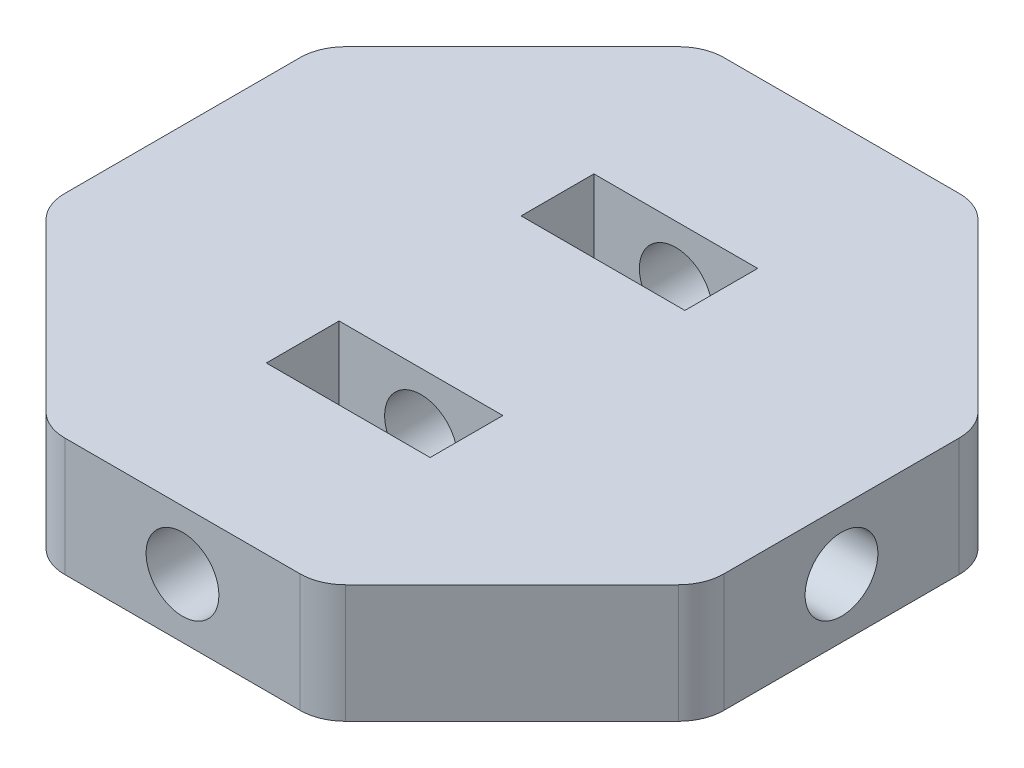
ISO-10303-21;
HEADER;
FILE_DESCRIPTION(('STEP AP214'),'2;1');
FILE_NAME('part.step','',(''),(''),'','','');
FILE_SCHEMA(('AUTOMOTIVE_DESIGN { 1 0 10303 214 1 1 1 1 }'));
ENDSEC;
DATA;
#1=APPLICATION_CONTEXT('core data for automotive mechanical design processes');
#2=APPLICATION_PROTOCOL_DEFINITION('international standard','automotive_design',2000,#1);
#3=PRODUCT_CONTEXT('',#1,'mechanical');
#4=PRODUCT('Part','Part','',(#3));
#5=PRODUCT_RELATED_PRODUCT_CATEGORY('part','',(#4));
#6=PRODUCT_DEFINITION_FORMATION('','',#4);
#7=PRODUCT_DEFINITION_CONTEXT('part definition',#1,'design');
#8=PRODUCT_DEFINITION('design','',#6,#7);
#9=PRODUCT_DEFINITION_SHAPE('','',#8);
#10=(LENGTH_UNIT() NAMED_UNIT(*) SI_UNIT(.MILLI.,.METRE.));
#11=(NAMED_UNIT(*) PLANE_ANGLE_UNIT() SI_UNIT($,.RADIAN.));
#12=(NAMED_UNIT(*) SI_UNIT($,.STERADIAN.) SOLID_ANGLE_UNIT());
#13=UNCERTAINTY_MEASURE_WITH_UNIT(LENGTH_MEASURE(1.E-05),#10,'distance_accuracy_value','');
#14=(GEOMETRIC_REPRESENTATION_CONTEXT(3) GLOBAL_UNCERTAINTY_ASSIGNED_CONTEXT((#13)) GLOBAL_UNIT_ASSIGNED_CONTEXT((#10,
#11,#12)) REPRESENTATION_CONTEXT('',''));
#15=CARTESIAN_POINT('',(0.,0.,0.));
#16=DIRECTION('',(0.,0.,1.));
#17=DIRECTION('',(1.,0.,0.));
#18=AXIS2_PLACEMENT_3D('',#15,#16,#17);
#19=CARTESIAN_POINT('',(2.5546394039017E-13,6.5,-36.213203435595));
#20=DIRECTION('',(0.,0.,1.));
#21=DIRECTION('',(1.,0.,0.));
#22=AXIS2_PLACEMENT_3D('',#19,#20,#21);
#23=CYLINDRICAL_SURFACE('',#22,4.);
#24=CARTESIAN_POINT('',(2.5546394039017E-13,6.5,-18.));
#25=DIRECTION('',(0.,0.,-1.));
#26=DIRECTION('',(-1.,0.,0.));
#27=AXIS2_PLACEMENT_3D('',#24,#25,#26);
#28=CIRCLE('',#27,4.);
#29=CARTESIAN_POINT('',(-3.99999999999974,6.5,-18.));
#30=VERTEX_POINT('',#29);
#31=EDGE_CURVE('E261',#30,#30,#28,.F.);
#32=ORIENTED_EDGE('',*,*,#31,.T.);
#33=EDGE_LOOP('',(#32));
#34=FACE_BOUND('',#33,.T.);
#35=CARTESIAN_POINT('',(2.5546394039017E-13,6.5,-36.213203435595));
#36=DIRECTION('',(0.,0.,1.));
#37=DIRECTION('',(1.,0.,0.));
#38=AXIS2_PLACEMENT_3D('',#35,#36,#37);
#39=CIRCLE('',#38,4.);
#40=CARTESIAN_POINT('',(4.00000000000026,6.5,-36.213203435595));
#41=VERTEX_POINT('',#40);
#42=EDGE_CURVE('E278',#41,#41,#39,.T.);
#43=ORIENTED_EDGE('',*,*,#42,.F.);
#44=EDGE_LOOP('',(#43));
#45=FACE_BOUND('',#44,.T.);
#46=ADVANCED_FACE('F31',(#34,#45),#23,.F.);
#47=CARTESIAN_POINT('',(2.5546394039017E-13,6.5,10.));
#48=DIRECTION('',(0.,0.,-1.));
#49=DIRECTION('',(-1.,0.,0.));
#50=AXIS2_PLACEMENT_3D('',#47,#48,#49);
#51=CIRCLE('',#50,4.);
#52=CARTESIAN_POINT('',(-3.99999999999974,6.5,10.));
#53=VERTEX_POINT('',#52);
#54=EDGE_CURVE('E285',#53,#53,#51,.F.);
#55=ORIENTED_EDGE('',*,*,#54,.T.);
#56=EDGE_LOOP('',(#55));
#57=FACE_BOUND('',#56,.T.);
#58=CARTESIAN_POINT('',(2.56101507417368E-13,6.5,-1.25767452008317E-13));
#59=DIRECTION('',(0.707106781186552,0.,-0.707106781186543));
#60=DIRECTION('',(0.707106781186543,0.,0.707106781186552));
#61=AXIS2_PLACEMENT_3D('',#58,#59,#60);
#62=ELLIPSE('',#61,5.65685424949242,4.);
#63=CARTESIAN_POINT('',(2.56101507417368E-13,2.5,-1.25767452008317E-13));
#64=VERTEX_POINT('',#63);
#65=CARTESIAN_POINT('',(2.56101507417368E-13,10.5,-1.25767452008317E-13));
#66=VERTEX_POINT('',#65);
#67=EDGE_CURVE('E315',#64,#66,#62,.F.);
#68=ORIENTED_EDGE('',*,*,#67,.F.);
#69=CARTESIAN_POINT('',(2.56101507417368E-13,6.5,-1.25767452008317E-13));
#70=DIRECTION('',(0.707106781186543,0.,0.707106781186552));
#71=DIRECTION('',(0.707106781186552,0.,-0.707106781186543));
#72=AXIS2_PLACEMENT_3D('',#69,#70,#71);
#73=ELLIPSE('',#72,5.65685424949235,4.);
#74=EDGE_CURVE('E341',#66,#64,#73,.T.);
#75=ORIENTED_EDGE('',*,*,#74,.F.);
#76=EDGE_LOOP('',(#68,#75));
#77=FACE_BOUND('',#76,.T.);
#78=ADVANCED_FACE('F494',(#57,#77),#23,.F.);
#79=CARTESIAN_POINT('',(-36.2142034355959,6.5,-5.70574324381889E-13));
#80=DIRECTION('',(1.,0.,0.));
#81=DIRECTION('',(0.,0.,-1.));
#82=AXIS2_PLACEMENT_3D('',#79,#80,#81);
#83=CYLINDRICAL_SURFACE('',#82,4.);
#84=CARTESIAN_POINT('',(36.2132034355951,6.5,3.17292438176701E-13));
#85=DIRECTION('',(1.,0.,0.));
#86=DIRECTION('',(0.,0.,-1.));
#87=AXIS2_PLACEMENT_3D('',#84,#85,#86);
#88=CIRCLE('',#87,4.);
#89=CARTESIAN_POINT('',(36.2132034355951,6.5,-3.99999999999968));
#90=VERTEX_POINT('',#89);
#91=EDGE_CURVE('E281',#90,#90,#88,.T.);
#92=ORIENTED_EDGE('',*,*,#91,.T.);
#93=EDGE_LOOP('',(#92));
#94=FACE_BOUND('',#93,.T.);
#95=ORIENTED_EDGE('',*,*,#67,.T.);
#96=CARTESIAN_POINT('',(2.56101507417368E-13,6.5,-1.25767452008317E-13));
#97=DIRECTION('',(0.707106781186543,0.,0.707106781186552));
#98=DIRECTION('',(0.707106781186552,0.,-0.707106781186543));
#99=AXIS2_PLACEMENT_3D('',#96,#97,#98);
#100=ELLIPSE('',#99,5.65685424949235,4.);
#101=EDGE_CURVE('E344',#66,#64,#100,.F.);
#102=ORIENTED_EDGE('',*,*,#101,.T.);
#103=EDGE_LOOP('',(#95,#102));
#104=FACE_BOUND('',#103,.T.);
#105=ADVANCED_FACE('F501',(#94,#104),#83,.F.);
#106=CARTESIAN_POINT('',(36.2132034355949,13.,15.0000000000009));
#107=DIRECTION('',(-1.,0.,0.));
#108=DIRECTION('',(0.,0.,1.));
#109=AXIS2_PLACEMENT_3D('',#106,#107,#108);
#110=PLANE('',#109);
#111=ORIENTED_EDGE('',*,*,#91,.F.);
#112=EDGE_LOOP('',(#111));
#113=FACE_BOUND('',#112,.T.);
#114=DIRECTION('',(0.,0.,-1.));
#115=VECTOR('',#114,1.);
#116=CARTESIAN_POINT('',(36.2132034355949,0.,15.0000000000009));
#117=LINE('',#116,#115);
#118=CARTESIAN_POINT('',(36.2132034355949,0.,12.9289321881355));
#119=VERTEX_POINT('',#118);
#120=CARTESIAN_POINT('',(36.2132034355952,0.,-12.9289321881348));
#121=VERTEX_POINT('',#120);
#122=EDGE_CURVE('E291',#119,#121,#117,.T.);
#123=ORIENTED_EDGE('',*,*,#122,.T.);
#124=DIRECTION('',(0.,-1.,0.));
#125=VECTOR('',#124,1.);
#126=CARTESIAN_POINT('',(36.2132034355952,13.,-12.9289321881348));
#127=LINE('',#126,#125);
#128=CARTESIAN_POINT('',(36.2132034355952,13.,-12.9289321881348));
#129=VERTEX_POINT('',#128);
#130=EDGE_CURVE('E399',#121,#129,#127,.F.);
#131=ORIENTED_EDGE('',*,*,#130,.T.);
#132=DIRECTION('',(0.,0.,-1.));
#133=VECTOR('',#132,1.);
#134=CARTESIAN_POINT('',(36.2132034355949,13.,15.0000000000009));
#135=LINE('',#134,#133);
#136=CARTESIAN_POINT('',(36.2132034355949,13.,12.9289321881355));
#137=VERTEX_POINT('',#136);
#138=EDGE_CURVE('E292',#137,#129,#135,.T.);
#139=ORIENTED_EDGE('',*,*,#138,.F.);
#140=DIRECTION('',(0.,-1.,0.));
#141=VECTOR('',#140,1.);
#142=CARTESIAN_POINT('',(36.2132034355949,13.,12.9289321881355));
#143=LINE('',#142,#141);
#144=EDGE_CURVE('E396',#137,#119,#143,.T.);
#145=ORIENTED_EDGE('',*,*,#144,.T.);
#146=EDGE_LOOP('',(#123,#131,#139,#145));
#147=FACE_BOUND('',#146,.T.);
#148=ADVANCED_FACE('F470',(#113,#147),#110,.F.);
#149=CARTESIAN_POINT('',(36.2132034355953,13.,-15.0000000000003));
#150=DIRECTION('',(-0.707106781186547,0.,0.707106781186548));
#151=DIRECTION('',(0.707106781186548,0.,0.707106781186547));
#152=AXIS2_PLACEMENT_3D('',#149,#150,#151);
#153=PLANE('',#152);
#154=DIRECTION('',(-0.707106781186548,0.,-0.707106781186547));
#155=VECTOR('',#154,1.);
#156=CARTESIAN_POINT('',(36.2132034355953,0.,-15.0000000000003));
#157=LINE('',#156,#155);
#158=CARTESIAN_POINT('',(34.748737341528,0.,-16.4644660940676));
#159=VERTEX_POINT('',#158);
#160=CARTESIAN_POINT('',(16.4644660940678,0.,-34.7487373415278));
#161=VERTEX_POINT('',#160);
#162=EDGE_CURVE('E318',#159,#161,#157,.T.);
#163=ORIENTED_EDGE('',*,*,#162,.T.);
#164=DIRECTION('',(0.,-1.,0.));
#165=VECTOR('',#164,1.);
#166=CARTESIAN_POINT('',(16.4644660940678,13.,-34.7487373415278));
#167=LINE('',#166,#165);
#168=CARTESIAN_POINT('',(16.4644660940678,13.,-34.7487373415278));
#169=VERTEX_POINT('',#168);
#170=EDGE_CURVE('E379',#161,#169,#167,.F.);
#171=ORIENTED_EDGE('',*,*,#170,.T.);
#172=DIRECTION('',(-0.707106781186548,0.,-0.707106781186547));
#173=VECTOR('',#172,1.);
#174=CARTESIAN_POINT('',(36.2132034355953,13.,-15.0000000000003));
#175=LINE('',#174,#173);
#176=CARTESIAN_POINT('',(34.748737341528,13.,-16.4644660940676));
#177=VERTEX_POINT('',#176);
#178=EDGE_CURVE('E295',#177,#169,#175,.T.);
#179=ORIENTED_EDGE('',*,*,#178,.F.);
#180=DIRECTION('',(0.,-1.,0.));
#181=VECTOR('',#180,1.);
#182=CARTESIAN_POINT('',(34.748737341528,13.,-16.4644660940676));
#183=LINE('',#182,#181);
#184=EDGE_CURVE('E376',#177,#159,#183,.T.);
#185=ORIENTED_EDGE('',*,*,#184,.T.);
#186=EDGE_LOOP('',(#163,#171,#179,#185));
#187=FACE_BOUND('',#186,.T.);
#188=ADVANCED_FACE('F479',(#187),#153,.F.);
#189=CARTESIAN_POINT('',(15.0000000000005,13.,-36.213203435595));
#190=DIRECTION('',(0.,0.,1.));
#191=DIRECTION('',(1.,0.,0.));
#192=AXIS2_PLACEMENT_3D('',#189,#190,#191);
#193=PLANE('',#192);
#194=ORIENTED_EDGE('',*,*,#42,.T.);
#195=EDGE_LOOP('',(#194));
#196=FACE_BOUND('',#195,.T.);
#197=DIRECTION('',(-1.,0.,0.));
#198=VECTOR('',#197,1.);
#199=CARTESIAN_POINT('',(15.0000000000005,13.,-36.213203435595));
#200=LINE('',#199,#198);
#201=CARTESIAN_POINT('',(12.928932188135,13.,-36.213203435595));
#202=VERTEX_POINT('',#201);
#203=CARTESIAN_POINT('',(-12.9289321881339,13.,-36.213203435595));
#204=VERTEX_POINT('',#203);
#205=EDGE_CURVE('E299',#202,#204,#200,.T.);
#206=ORIENTED_EDGE('',*,*,#205,.F.);
#207=DIRECTION('',(0.,-1.,0.));
#208=VECTOR('',#207,1.);
#209=CARTESIAN_POINT('',(12.928932188135,13.,-36.213203435595));
#210=LINE('',#209,#208);
#211=CARTESIAN_POINT('',(12.928932188135,0.,-36.213203435595));
#212=VERTEX_POINT('',#211);
#213=EDGE_CURVE('E357',#202,#212,#210,.T.);
#214=ORIENTED_EDGE('',*,*,#213,.T.);
#215=DIRECTION('',(-1.,0.,0.));
#216=VECTOR('',#215,1.);
#217=CARTESIAN_POINT('',(15.0000000000005,0.,-36.213203435595));
#218=LINE('',#217,#216);
#219=CARTESIAN_POINT('',(-12.9289321881339,0.,-36.213203435595));
#220=VERTEX_POINT('',#219);
#221=EDGE_CURVE('E321',#212,#220,#218,.T.);
#222=ORIENTED_EDGE('',*,*,#221,.T.);
#223=DIRECTION('',(0.,-1.,0.));
#224=VECTOR('',#223,1.);
#225=CARTESIAN_POINT('',(-12.9289321881339,13.,-36.213203435595));
#226=LINE('',#225,#224);
#227=EDGE_CURVE('E347',#220,#204,#226,.F.);
#228=ORIENTED_EDGE('',*,*,#227,.T.);
#229=EDGE_LOOP('',(#206,#214,#222,#228));
#230=FACE_BOUND('',#229,.T.);
#231=ADVANCED_FACE('F487',(#196,#230),#193,.F.);
#232=CARTESIAN_POINT('',(-14.9999999999994,13.,-36.213203435595));
#233=DIRECTION('',(0.707106781186548,0.,0.707106781186547));
#234=DIRECTION('',(0.707106781186547,0.,-0.707106781186548));
#235=AXIS2_PLACEMENT_3D('',#232,#233,#234);
#236=PLANE('',#235);
#237=DIRECTION('',(-0.707106781186547,0.,0.707106781186548));
#238=VECTOR('',#237,1.);
#239=CARTESIAN_POINT('',(-14.9999999999994,0.,-36.213203435595));
#240=LINE('',#239,#238);
#241=CARTESIAN_POINT('',(-16.4644660940666,0.,-34.7487373415278));
#242=VERTEX_POINT('',#241);
#243=CARTESIAN_POINT('',(-34.7487373415282,0.,-16.4644660940662));
#244=VERTEX_POINT('',#243);
#245=EDGE_CURVE('E324',#242,#244,#240,.T.);
#246=ORIENTED_EDGE('',*,*,#245,.T.);
#247=DIRECTION('',(0.,-1.,0.));
#248=VECTOR('',#247,1.);
#249=CARTESIAN_POINT('',(-34.7487373415282,13.,-16.4644660940661));
#250=LINE('',#249,#248);
#251=CARTESIAN_POINT('',(-34.7487373415282,13.,-16.4644660940662));
#252=VERTEX_POINT('',#251);
#253=EDGE_CURVE('E11',#244,#252,#250,.F.);
#254=ORIENTED_EDGE('',*,*,#253,.T.);
#255=DIRECTION('',(-0.707106781186547,0.,0.707106781186548));
#256=VECTOR('',#255,1.);
#257=CARTESIAN_POINT('',(-14.9999999999994,13.,-36.213203435595));
#258=LINE('',#257,#256);
#259=CARTESIAN_POINT('',(-16.4644660940666,13.,-34.7487373415278));
#260=VERTEX_POINT('',#259);
#261=EDGE_CURVE('E302',#260,#252,#258,.T.);
#262=ORIENTED_EDGE('',*,*,#261,.F.);
#263=DIRECTION('',(0.,-1.,0.));
#264=VECTOR('',#263,1.);
#265=CARTESIAN_POINT('',(-16.4644660940666,13.,-34.7487373415278));
#266=LINE('',#265,#264);
#267=EDGE_CURVE('E39',#260,#242,#266,.T.);
#268=ORIENTED_EDGE('',*,*,#267,.T.);
#269=EDGE_LOOP('',(#246,#254,#262,#268));
#270=FACE_BOUND('',#269,.T.);
#271=ADVANCED_FACE('F424',(#270),#236,.F.);
#272=CARTESIAN_POINT('',(-36.2132034355955,13.,-14.9999999999989));
#273=DIRECTION('',(1.,0.,0.));
#274=DIRECTION('',(0.,0.,-1.));
#275=AXIS2_PLACEMENT_3D('',#272,#273,#274);
#276=PLANE('',#275);
#277=CARTESIAN_POINT('',(-36.2132034355955,6.5,-5.7056206566932E-13));
#278=DIRECTION('',(1.,0.,0.));
#279=DIRECTION('',(0.,0.,-1.));
#280=AXIS2_PLACEMENT_3D('',#277,#278,#279);
#281=CIRCLE('',#280,4.);
#282=CARTESIAN_POINT('',(-36.2132034355955,6.5,-4.00000000000057));
#283=VERTEX_POINT('',#282);
#284=EDGE_CURVE('E288',#283,#283,#281,.F.);
#285=ORIENTED_EDGE('',*,*,#284,.F.);
#286=EDGE_LOOP('',(#285));
#287=FACE_BOUND('',#286,.T.);
#288=DIRECTION('',(0.,0.,1.));
#289=VECTOR('',#288,1.);
#290=CARTESIAN_POINT('',(-36.2132034355955,0.,-14.9999999999989));
#291=LINE('',#290,#289);
#292=CARTESIAN_POINT('',(-36.2132034355955,0.,-12.9289321881334));
#293=VERTEX_POINT('',#292);
#294=CARTESIAN_POINT('',(-36.2132034355955,0.,12.9289321881354));
#295=VERTEX_POINT('',#294);
#296=EDGE_CURVE('E327',#293,#295,#291,.T.);
#297=ORIENTED_EDGE('',*,*,#296,.T.);
#298=DIRECTION('',(0.,-1.,0.));
#299=VECTOR('',#298,1.);
#300=CARTESIAN_POINT('',(-36.2132034355955,13.,12.9289321881354));
#301=LINE('',#300,#299);
#302=CARTESIAN_POINT('',(-36.2132034355955,13.,12.9289321881354));
#303=VERTEX_POINT('',#302);
#304=EDGE_CURVE('E418',#295,#303,#301,.F.);
#305=ORIENTED_EDGE('',*,*,#304,.T.);
#306=DIRECTION('',(0.,0.,1.));
#307=VECTOR('',#306,1.);
#308=CARTESIAN_POINT('',(-36.2132034355955,13.,-14.9999999999989));
#309=LINE('',#308,#307);
#310=CARTESIAN_POINT('',(-36.2132034355955,13.,-12.9289321881334));
#311=VERTEX_POINT('',#310);
#312=EDGE_CURVE('E305',#311,#303,#309,.T.);
#313=ORIENTED_EDGE('',*,*,#312,.F.);
#314=DIRECTION('',(0.,-1.,0.));
#315=VECTOR('',#314,1.);
#316=CARTESIAN_POINT('',(-36.2132034355955,13.,-12.9289321881334));
#317=LINE('',#316,#315);
#318=EDGE_CURVE('E415',#311,#293,#317,.T.);
#319=ORIENTED_EDGE('',*,*,#318,.T.);
#320=EDGE_LOOP('',(#297,#305,#313,#319));
#321=FACE_BOUND('',#320,.T.);
#322=ADVANCED_FACE('F437',(#287,#321),#276,.F.);
#323=CARTESIAN_POINT('',(-36.2132034355955,13.,15.0000000000009));
#324=DIRECTION('',(0.707106781186535,0.,-0.70710678118656));
#325=DIRECTION('',(-0.70710678118656,0.,-0.707106781186535));
#326=AXIS2_PLACEMENT_3D('',#323,#324,#325);
#327=PLANE('',#326);
#328=DIRECTION('',(0.70710678118656,0.,0.707106781186535));
#329=VECTOR('',#328,1.);
#330=CARTESIAN_POINT('',(-36.2132034355955,0.,15.0000000000009));
#331=LINE('',#330,#329);
#332=CARTESIAN_POINT('',(-34.7487373415282,0.,16.4644660940682));
#333=VERTEX_POINT('',#332);
#334=CARTESIAN_POINT('',(-16.4644660940672,0.,34.7487373415285));
#335=VERTEX_POINT('',#334);
#336=EDGE_CURVE('E330',#333,#335,#331,.T.);
#337=ORIENTED_EDGE('',*,*,#336,.T.);
#338=DIRECTION('',(0.,-1.,0.));
#339=VECTOR('',#338,1.);
#340=CARTESIAN_POINT('',(-16.4644660940672,13.,34.7487373415285));
#341=LINE('',#340,#339);
#342=CARTESIAN_POINT('',(-16.4644660940672,13.,34.7487373415285));
#343=VERTEX_POINT('',#342);
#344=EDGE_CURVE('E413',#335,#343,#341,.F.);
#345=ORIENTED_EDGE('',*,*,#344,.T.);
#346=DIRECTION('',(0.70710678118656,0.,0.707106781186535));
#347=VECTOR('',#346,1.);
#348=CARTESIAN_POINT('',(-36.2132034355955,13.,15.0000000000009));
#349=LINE('',#348,#347);
#350=CARTESIAN_POINT('',(-34.7487373415282,13.,16.4644660940682));
#351=VERTEX_POINT('',#350);
#352=EDGE_CURVE('E308',#351,#343,#349,.T.);
#353=ORIENTED_EDGE('',*,*,#352,.F.);
#354=DIRECTION('',(0.,-1.,0.));
#355=VECTOR('',#354,1.);
#356=CARTESIAN_POINT('',(-34.7487373415282,13.,16.4644660940682));
#357=LINE('',#356,#355);
#358=EDGE_CURVE('E410',#351,#333,#357,.T.);
#359=ORIENTED_EDGE('',*,*,#358,.T.);
#360=EDGE_LOOP('',(#337,#345,#353,#359));
#361=FACE_BOUND('',#360,.T.);
#362=ADVANCED_FACE('F447',(#361),#327,.F.);
#363=CARTESIAN_POINT('',(-15.,13.,36.2132034355957));
#364=DIRECTION('',(0.,0.,-1.));
#365=DIRECTION('',(-1.,0.,0.));
#366=AXIS2_PLACEMENT_3D('',#363,#364,#365);
#367=PLANE('',#366);
#368=CARTESIAN_POINT('',(2.5546394039017E-13,6.5,36.2132034355959));
#369=DIRECTION('',(0.,0.,1.));
#370=DIRECTION('',(1.,0.,0.));
#371=AXIS2_PLACEMENT_3D('',#368,#369,#370);
#372=CIRCLE('',#371,4.);
#373=CARTESIAN_POINT('',(4.00000000000026,6.5,36.2132034355959));
#374=VERTEX_POINT('',#373);
#375=EDGE_CURVE('E282',#374,#374,#372,.T.);
#376=ORIENTED_EDGE('',*,*,#375,.F.);
#377=EDGE_LOOP('',(#376));
#378=FACE_BOUND('',#377,.T.);
#379=DIRECTION('',(1.,0.,0.));
#380=VECTOR('',#379,1.);
#381=CARTESIAN_POINT('',(-15.,0.,36.2132034355957));
#382=LINE('',#381,#380);
#383=CARTESIAN_POINT('',(-12.9289321881346,0.,36.2132034355957));
#384=VERTEX_POINT('',#383);
#385=CARTESIAN_POINT('',(12.9289321881349,0.,36.213203435596));
#386=VERTEX_POINT('',#385);
#387=EDGE_CURVE('E333',#384,#386,#382,.T.);
#388=ORIENTED_EDGE('',*,*,#387,.T.);
#389=DIRECTION('',(0.,-1.,0.));
#390=VECTOR('',#389,1.);
#391=CARTESIAN_POINT('',(12.9289321881349,13.,36.213203435596));
#392=LINE('',#391,#390);
#393=CARTESIAN_POINT('',(12.9289321881349,13.,36.213203435596));
#394=VERTEX_POINT('',#393);
#395=EDGE_CURVE('E408',#386,#394,#392,.F.);
#396=ORIENTED_EDGE('',*,*,#395,.T.);
#397=DIRECTION('',(1.,0.,0.));
#398=VECTOR('',#397,1.);
#399=CARTESIAN_POINT('',(-15.,13.,36.2132034355957));
#400=LINE('',#399,#398);
#401=CARTESIAN_POINT('',(-12.9289321881346,13.,36.2132034355957));
#402=VERTEX_POINT('',#401);
#403=EDGE_CURVE('E311',#402,#394,#400,.T.);
#404=ORIENTED_EDGE('',*,*,#403,.F.);
#405=DIRECTION('',(0.,-1.,0.));
#406=VECTOR('',#405,1.);
#407=CARTESIAN_POINT('',(-12.9289321881346,13.,36.2132034355957));
#408=LINE('',#407,#406);
#409=EDGE_CURVE('E405',#402,#384,#408,.T.);
#410=ORIENTED_EDGE('',*,*,#409,.T.);
#411=EDGE_LOOP('',(#388,#396,#404,#410));
#412=FACE_BOUND('',#411,.T.);
#413=ADVANCED_FACE('F456',(#378,#412),#367,.F.);
#414=CARTESIAN_POINT('',(15.0000000000005,13.,36.2132034355961));
#415=DIRECTION('',(-0.70710678118656,0.,-0.707106781186535));
#416=DIRECTION('',(-0.707106781186535,0.,0.70710678118656));
#417=AXIS2_PLACEMENT_3D('',#414,#415,#416);
#418=PLANE('',#417);
#419=DIRECTION('',(0.707106781186535,0.,-0.70710678118656));
#420=VECTOR('',#419,1.);
#421=CARTESIAN_POINT('',(15.0000000000005,0.,36.2132034355961));
#422=LINE('',#421,#420);
#423=CARTESIAN_POINT('',(16.4644660940678,0.,34.7487373415287));
#424=VERTEX_POINT('',#423);
#425=CARTESIAN_POINT('',(34.7487373415277,0.,16.4644660940682));
#426=VERTEX_POINT('',#425);
#427=EDGE_CURVE('E296',#424,#426,#422,.T.);
#428=ORIENTED_EDGE('',*,*,#427,.T.);
#429=DIRECTION('',(0.,-1.,0.));
#430=VECTOR('',#429,1.);
#431=CARTESIAN_POINT('',(34.7487373415277,13.,16.4644660940682));
#432=LINE('',#431,#430);
#433=CARTESIAN_POINT('',(34.7487373415277,13.,16.4644660940682));
#434=VERTEX_POINT('',#433);
#435=EDGE_CURVE('E46',#426,#434,#432,.F.);
#436=ORIENTED_EDGE('',*,*,#435,.T.);
#437=DIRECTION('',(0.707106781186535,0.,-0.70710678118656));
#438=VECTOR('',#437,1.);
#439=CARTESIAN_POINT('',(15.0000000000005,13.,36.2132034355961));
#440=LINE('',#439,#438);
#441=CARTESIAN_POINT('',(16.4644660940678,13.,34.7487373415287));
#442=VERTEX_POINT('',#441);
#443=EDGE_CURVE('E313',#442,#434,#440,.T.);
#444=ORIENTED_EDGE('',*,*,#443,.F.);
#445=DIRECTION('',(0.,-1.,0.));
#446=VECTOR('',#445,1.);
#447=CARTESIAN_POINT('',(16.4644660940678,13.,34.7487373415287));
#448=LINE('',#447,#446);
#449=EDGE_CURVE('E401',#442,#424,#448,.T.);
#450=ORIENTED_EDGE('',*,*,#449,.T.);
#451=EDGE_LOOP('',(#428,#436,#444,#450));
#452=FACE_BOUND('',#451,.T.);
#453=ADVANCED_FACE('F462',(#452),#418,.F.);
#454=CARTESIAN_POINT('',(36.2132034355955,13.,-36.213203435595));
#455=DIRECTION('',(0.,1.,0.));
#456=DIRECTION('',(0.,0.,1.));
#457=AXIS2_PLACEMENT_3D('',#454,#455,#456);
#458=PLANE('',#457);
#459=DIRECTION('',(0.,0.,1.));
#460=VECTOR('',#459,1.);
#461=CARTESIAN_POINT('',(-9.,13.,-10.));
#462=LINE('',#461,#460);
#463=CARTESIAN_POINT('',(-9.,13.,-18.));
#464=VERTEX_POINT('',#463);
#465=CARTESIAN_POINT('',(-8.99999999999999,13.,-10.));
#466=VERTEX_POINT('',#465);
#467=EDGE_CURVE('E206',#464,#466,#462,.T.);
#468=ORIENTED_EDGE('',*,*,#467,.F.);
#469=DIRECTION('',(-1.,0.,0.));
#470=VECTOR('',#469,1.);
#471=CARTESIAN_POINT('',(-9.,13.,-18.));
#472=LINE('',#471,#470);
#473=CARTESIAN_POINT('',(9.,13.,-18.));
#474=VERTEX_POINT('',#473);
#475=EDGE_CURVE('E225',#474,#464,#472,.T.);
#476=ORIENTED_EDGE('',*,*,#475,.F.);
#477=DIRECTION('',(0.,0.,-1.));
#478=VECTOR('',#477,1.);
#479=CARTESIAN_POINT('',(9.,13.,-10.));
#480=LINE('',#479,#478);
#481=CARTESIAN_POINT('',(9.,13.,-10.));
#482=VERTEX_POINT('',#481);
#483=EDGE_CURVE('E228',#482,#474,#480,.T.);
#484=ORIENTED_EDGE('',*,*,#483,.F.);
#485=DIRECTION('',(1.,0.,0.));
#486=VECTOR('',#485,1.);
#487=CARTESIAN_POINT('',(-9.,13.,-10.));
#488=LINE('',#487,#486);
#489=EDGE_CURVE('E234',#466,#482,#488,.T.);
#490=ORIENTED_EDGE('',*,*,#489,.F.);
#491=EDGE_LOOP('',(#468,#476,#484,#490));
#492=FACE_BOUND('',#491,.T.);
#493=DIRECTION('',(0.,0.,1.));
#494=VECTOR('',#493,1.);
#495=CARTESIAN_POINT('',(-9.,13.,10.));
#496=LINE('',#495,#494);
#497=CARTESIAN_POINT('',(-9.,13.,10.));
#498=VERTEX_POINT('',#497);
#499=CARTESIAN_POINT('',(-8.99999999999999,13.,18.));
#500=VERTEX_POINT('',#499);
#501=EDGE_CURVE('E258',#498,#500,#496,.T.);
#502=ORIENTED_EDGE('',*,*,#501,.F.);
#503=DIRECTION('',(-1.,0.,0.));
#504=VECTOR('',#503,1.);
#505=CARTESIAN_POINT('',(-9.,13.,10.));
#506=LINE('',#505,#504);
#507=CARTESIAN_POINT('',(9.,13.,10.));
#508=VERTEX_POINT('',#507);
#509=EDGE_CURVE('E248',#508,#498,#506,.T.);
#510=ORIENTED_EDGE('',*,*,#509,.F.);
#511=DIRECTION('',(0.,0.,-1.));
#512=VECTOR('',#511,1.);
#513=CARTESIAN_POINT('',(9.,13.,10.));
#514=LINE('',#513,#512);
#515=CARTESIAN_POINT('',(9.,13.,18.));
#516=VERTEX_POINT('',#515);
#517=EDGE_CURVE('E264',#516,#508,#514,.T.);
#518=ORIENTED_EDGE('',*,*,#517,.F.);
#519=DIRECTION('',(1.,0.,0.));
#520=VECTOR('',#519,1.);
#521=CARTESIAN_POINT('',(-9.,13.,18.));
#522=LINE('',#521,#520);
#523=EDGE_CURVE('E260',#500,#516,#522,.T.);
#524=ORIENTED_EDGE('',*,*,#523,.F.);
#525=EDGE_LOOP('',(#502,#510,#518,#524));
#526=FACE_BOUND('',#525,.T.);
#527=ORIENTED_EDGE('',*,*,#178,.T.);
#528=CARTESIAN_POINT('',(12.928932188135,13.,-31.213203435595));
#529=DIRECTION('',(0.,1.,0.));
#530=DIRECTION('',(0.,0.,1.));
#531=AXIS2_PLACEMENT_3D('',#528,#529,#530);
#532=CIRCLE('',#531,5.);
#533=EDGE_CURVE('E394',#169,#202,#532,.T.);
#534=ORIENTED_EDGE('',*,*,#533,.T.);
#535=ORIENTED_EDGE('',*,*,#205,.T.);
#536=CARTESIAN_POINT('',(-12.9289321881339,13.,-31.213203435595));
#537=DIRECTION('',(0.,1.,0.));
#538=DIRECTION('',(0.,0.,1.));
#539=AXIS2_PLACEMENT_3D('',#536,#537,#538);
#540=CIRCLE('',#539,5.);
#541=EDGE_CURVE('E381',#204,#260,#540,.T.);
#542=ORIENTED_EDGE('',*,*,#541,.T.);
#543=ORIENTED_EDGE('',*,*,#261,.T.);
#544=CARTESIAN_POINT('',(-31.2132034355955,13.,-12.9289321881334));
#545=DIRECTION('',(0.,1.,0.));
#546=DIRECTION('',(0.,0.,1.));
#547=AXIS2_PLACEMENT_3D('',#544,#545,#546);
#548=CIRCLE('',#547,5.);
#549=EDGE_CURVE('E383',#252,#311,#548,.T.);
#550=ORIENTED_EDGE('',*,*,#549,.T.);
#551=ORIENTED_EDGE('',*,*,#312,.T.);
#552=CARTESIAN_POINT('',(-31.2132034355955,13.,12.9289321881354));
#553=DIRECTION('',(0.,1.,0.));
#554=DIRECTION('',(0.,0.,1.));
#555=AXIS2_PLACEMENT_3D('',#552,#553,#554);
#556=CIRCLE('',#555,5.);
#557=EDGE_CURVE('E385',#303,#351,#556,.T.);
#558=ORIENTED_EDGE('',*,*,#557,.T.);
#559=ORIENTED_EDGE('',*,*,#352,.T.);
#560=CARTESIAN_POINT('',(-12.9289321881345,13.,31.2132034355957));
#561=DIRECTION('',(0.,1.,0.));
#562=DIRECTION('',(0.,0.,1.));
#563=AXIS2_PLACEMENT_3D('',#560,#561,#562);
#564=CIRCLE('',#563,5.);
#565=EDGE_CURVE('E387',#343,#402,#564,.T.);
#566=ORIENTED_EDGE('',*,*,#565,.T.);
#567=ORIENTED_EDGE('',*,*,#403,.T.);
#568=CARTESIAN_POINT('',(12.928932188135,13.,31.213203435596));
#569=DIRECTION('',(0.,1.,0.));
#570=DIRECTION('',(0.,0.,1.));
#571=AXIS2_PLACEMENT_3D('',#568,#569,#570);
#572=CIRCLE('',#571,5.);
#573=EDGE_CURVE('E53',#394,#442,#572,.T.);
#574=ORIENTED_EDGE('',*,*,#573,.T.);
#575=ORIENTED_EDGE('',*,*,#443,.T.);
#576=CARTESIAN_POINT('',(31.2132034355949,13.,12.9289321881355));
#577=DIRECTION('',(0.,1.,0.));
#578=DIRECTION('',(0.,0.,1.));
#579=AXIS2_PLACEMENT_3D('',#576,#577,#578);
#580=CIRCLE('',#579,5.);
#581=EDGE_CURVE('E390',#434,#137,#580,.T.);
#582=ORIENTED_EDGE('',*,*,#581,.T.);
#583=ORIENTED_EDGE('',*,*,#138,.T.);
#584=CARTESIAN_POINT('',(31.2132034355952,13.,-12.9289321881348));
#585=DIRECTION('',(0.,1.,0.));
#586=DIRECTION('',(0.,0.,1.));
#587=AXIS2_PLACEMENT_3D('',#584,#585,#586);
#588=CIRCLE('',#587,5.);
#589=EDGE_CURVE('E392',#129,#177,#588,.T.);
#590=ORIENTED_EDGE('',*,*,#589,.T.);
#591=EDGE_LOOP('',(#527,#534,#535,#542,#543,#550,#551,#558,#559,#566,#567,#574,#575,#582,#583,#590));
#592=FACE_BOUND('',#591,.T.);
#593=ADVANCED_FACE('F440',(#492,#526,#592),#458,.T.);
#594=CARTESIAN_POINT('',(36.2132034355955,0.,-36.213203435595));
#595=DIRECTION('',(0.,1.,0.));
#596=DIRECTION('',(0.,0.,1.));
#597=AXIS2_PLACEMENT_3D('',#594,#595,#596);
#598=PLANE('',#597);
#599=DIRECTION('',(-1.,0.,0.));
#600=VECTOR('',#599,1.);
#601=CARTESIAN_POINT('',(-9.,0.,-18.));
#602=LINE('',#601,#600);
#603=CARTESIAN_POINT('',(9.,0.,-18.));
#604=VERTEX_POINT('',#603);
#605=CARTESIAN_POINT('',(-9.,0.,-18.));
#606=VERTEX_POINT('',#605);
#607=EDGE_CURVE('E211',#604,#606,#602,.T.);
#608=ORIENTED_EDGE('',*,*,#607,.T.);
#609=DIRECTION('',(0.,0.,1.));
#610=VECTOR('',#609,1.);
#611=CARTESIAN_POINT('',(-9.,0.,-10.));
#612=LINE('',#611,#610);
#613=CARTESIAN_POINT('',(-9.,0.,-10.));
#614=VERTEX_POINT('',#613);
#615=EDGE_CURVE('E203',#606,#614,#612,.T.);
#616=ORIENTED_EDGE('',*,*,#615,.T.);
#617=DIRECTION('',(1.,0.,0.));
#618=VECTOR('',#617,1.);
#619=CARTESIAN_POINT('',(-9.,0.,-10.));
#620=LINE('',#619,#618);
#621=CARTESIAN_POINT('',(8.99999999999999,0.,-10.));
#622=VERTEX_POINT('',#621);
#623=EDGE_CURVE('E215',#614,#622,#620,.T.);
#624=ORIENTED_EDGE('',*,*,#623,.T.);
#625=DIRECTION('',(0.,0.,-1.));
#626=VECTOR('',#625,1.);
#627=CARTESIAN_POINT('',(9.,0.,-10.));
#628=LINE('',#627,#626);
#629=EDGE_CURVE('E220',#622,#604,#628,.T.);
#630=ORIENTED_EDGE('',*,*,#629,.T.);
#631=EDGE_LOOP('',(#608,#616,#624,#630));
#632=FACE_BOUND('',#631,.T.);
#633=DIRECTION('',(-1.,0.,0.));
#634=VECTOR('',#633,1.);
#635=CARTESIAN_POINT('',(-9.,0.,10.));
#636=LINE('',#635,#634);
#637=CARTESIAN_POINT('',(9.,0.,10.));
#638=VERTEX_POINT('',#637);
#639=CARTESIAN_POINT('',(-9.,0.,10.));
#640=VERTEX_POINT('',#639);
#641=EDGE_CURVE('E254',#638,#640,#636,.T.);
#642=ORIENTED_EDGE('',*,*,#641,.T.);
#643=DIRECTION('',(0.,0.,1.));
#644=VECTOR('',#643,1.);
#645=CARTESIAN_POINT('',(-9.,0.,10.));
#646=LINE('',#645,#644);
#647=CARTESIAN_POINT('',(-9.,0.,18.));
#648=VERTEX_POINT('',#647);
#649=EDGE_CURVE('E244',#640,#648,#646,.T.);
#650=ORIENTED_EDGE('',*,*,#649,.T.);
#651=DIRECTION('',(1.,0.,0.));
#652=VECTOR('',#651,1.);
#653=CARTESIAN_POINT('',(-9.,0.,18.));
#654=LINE('',#653,#652);
#655=CARTESIAN_POINT('',(9.,0.,18.));
#656=VERTEX_POINT('',#655);
#657=EDGE_CURVE('E247',#648,#656,#654,.T.);
#658=ORIENTED_EDGE('',*,*,#657,.T.);
#659=DIRECTION('',(0.,0.,-1.));
#660=VECTOR('',#659,1.);
#661=CARTESIAN_POINT('',(9.,0.,10.));
#662=LINE('',#661,#660);
#663=EDGE_CURVE('E251',#656,#638,#662,.T.);
#664=ORIENTED_EDGE('',*,*,#663,.T.);
#665=EDGE_LOOP('',(#642,#650,#658,#664));
#666=FACE_BOUND('',#665,.T.);
#667=ORIENTED_EDGE('',*,*,#221,.F.);
#668=CARTESIAN_POINT('',(12.928932188135,0.,-31.213203435595));
#669=DIRECTION('',(0.,1.,0.));
#670=DIRECTION('',(0.,0.,1.));
#671=AXIS2_PLACEMENT_3D('',#668,#669,#670);
#672=CIRCLE('',#671,5.);
#673=EDGE_CURVE('E374',#212,#161,#672,.F.);
#674=ORIENTED_EDGE('',*,*,#673,.T.);
#675=ORIENTED_EDGE('',*,*,#162,.F.);
#676=CARTESIAN_POINT('',(31.2132034355952,0.,-12.9289321881348));
#677=DIRECTION('',(0.,1.,0.));
#678=DIRECTION('',(0.,0.,1.));
#679=AXIS2_PLACEMENT_3D('',#676,#677,#678);
#680=CIRCLE('',#679,5.);
#681=EDGE_CURVE('E372',#159,#121,#680,.F.);
#682=ORIENTED_EDGE('',*,*,#681,.T.);
#683=ORIENTED_EDGE('',*,*,#122,.F.);
#684=CARTESIAN_POINT('',(31.2132034355949,0.,12.9289321881355));
#685=DIRECTION('',(0.,1.,0.));
#686=DIRECTION('',(0.,0.,1.));
#687=AXIS2_PLACEMENT_3D('',#684,#685,#686);
#688=CIRCLE('',#687,5.);
#689=EDGE_CURVE('E370',#119,#426,#688,.F.);
#690=ORIENTED_EDGE('',*,*,#689,.T.);
#691=ORIENTED_EDGE('',*,*,#427,.F.);
#692=CARTESIAN_POINT('',(12.928932188135,0.,31.213203435596));
#693=DIRECTION('',(0.,1.,0.));
#694=DIRECTION('',(0.,0.,1.));
#695=AXIS2_PLACEMENT_3D('',#692,#693,#694);
#696=CIRCLE('',#695,5.);
#697=EDGE_CURVE('E368',#424,#386,#696,.F.);
#698=ORIENTED_EDGE('',*,*,#697,.T.);
#699=ORIENTED_EDGE('',*,*,#387,.F.);
#700=CARTESIAN_POINT('',(-12.9289321881345,0.,31.2132034355957));
#701=DIRECTION('',(0.,1.,0.));
#702=DIRECTION('',(0.,0.,1.));
#703=AXIS2_PLACEMENT_3D('',#700,#701,#702);
#704=CIRCLE('',#703,5.);
#705=EDGE_CURVE('E366',#384,#335,#704,.F.);
#706=ORIENTED_EDGE('',*,*,#705,.T.);
#707=ORIENTED_EDGE('',*,*,#336,.F.);
#708=CARTESIAN_POINT('',(-31.2132034355955,0.,12.9289321881354));
#709=DIRECTION('',(0.,1.,0.));
#710=DIRECTION('',(0.,0.,1.));
#711=AXIS2_PLACEMENT_3D('',#708,#709,#710);
#712=CIRCLE('',#711,5.);
#713=EDGE_CURVE('E364',#333,#295,#712,.F.);
#714=ORIENTED_EDGE('',*,*,#713,.T.);
#715=ORIENTED_EDGE('',*,*,#296,.F.);
#716=CARTESIAN_POINT('',(-31.2132034355955,0.,-12.9289321881334));
#717=DIRECTION('',(0.,1.,0.));
#718=DIRECTION('',(0.,0.,1.));
#719=AXIS2_PLACEMENT_3D('',#716,#717,#718);
#720=CIRCLE('',#719,5.);
#721=EDGE_CURVE('E362',#293,#244,#720,.F.);
#722=ORIENTED_EDGE('',*,*,#721,.T.);
#723=ORIENTED_EDGE('',*,*,#245,.F.);
#724=CARTESIAN_POINT('',(-12.9289321881339,0.,-31.213203435595));
#725=DIRECTION('',(0.,1.,0.));
#726=DIRECTION('',(0.,0.,1.));
#727=AXIS2_PLACEMENT_3D('',#724,#725,#726);
#728=CIRCLE('',#727,5.);
#729=EDGE_CURVE('E360',#242,#220,#728,.F.);
#730=ORIENTED_EDGE('',*,*,#729,.T.);
#731=EDGE_LOOP('',(#667,#674,#675,#682,#683,#690,#691,#698,#699,#706,#707,#714,#715,#722,#723,#730));
#732=FACE_BOUND('',#731,.T.);
#733=ADVANCED_FACE('F222',(#632,#666,#732),#598,.F.);
#734=CARTESIAN_POINT('',(2.56101507417368E-13,6.5,-1.25767452008317E-13));
#735=DIRECTION('',(0.707106781186552,0.,-0.707106781186543));
#736=DIRECTION('',(0.707106781186543,0.,0.707106781186552));
#737=AXIS2_PLACEMENT_3D('',#734,#735,#736);
#738=ELLIPSE('',#737,5.65685424949242,4.);
#739=EDGE_CURVE('E338',#64,#66,#738,.T.);
#740=ORIENTED_EDGE('',*,*,#739,.T.);
#741=ORIENTED_EDGE('',*,*,#74,.T.);
#742=EDGE_LOOP('',(#740,#741));
#743=FACE_BOUND('',#742,.T.);
#744=ORIENTED_EDGE('',*,*,#284,.T.);
#745=EDGE_LOOP('',(#744));
#746=FACE_BOUND('',#745,.T.);
#747=ADVANCED_FACE('F517',(#743,#746),#83,.F.);
#748=CARTESIAN_POINT('',(2.5546394039017E-13,6.5,18.));
#749=DIRECTION('',(0.,0.,1.));
#750=DIRECTION('',(1.,0.,0.));
#751=AXIS2_PLACEMENT_3D('',#748,#749,#750);
#752=CIRCLE('',#751,4.);
#753=CARTESIAN_POINT('',(4.00000000000026,6.5,18.));
#754=VERTEX_POINT('',#753);
#755=EDGE_CURVE('E271',#754,#754,#752,.F.);
#756=ORIENTED_EDGE('',*,*,#755,.T.);
#757=EDGE_LOOP('',(#756));
#758=FACE_BOUND('',#757,.T.);
#759=ORIENTED_EDGE('',*,*,#375,.T.);
#760=EDGE_LOOP('',(#759));
#761=FACE_BOUND('',#760,.T.);
#762=ADVANCED_FACE('F503',(#758,#761),#23,.F.);
#763=CARTESIAN_POINT('',(2.5546394039017E-13,6.5,-10.));
#764=DIRECTION('',(0.,0.,1.));
#765=DIRECTION('',(1.,0.,0.));
#766=AXIS2_PLACEMENT_3D('',#763,#764,#765);
#767=CIRCLE('',#766,4.);
#768=CARTESIAN_POINT('',(4.00000000000026,6.5,-10.));
#769=VERTEX_POINT('',#768);
#770=EDGE_CURVE('E240',#769,#769,#767,.F.);
#771=ORIENTED_EDGE('',*,*,#770,.T.);
#772=EDGE_LOOP('',(#771));
#773=FACE_BOUND('',#772,.T.);
#774=ORIENTED_EDGE('',*,*,#739,.F.);
#775=ORIENTED_EDGE('',*,*,#101,.F.);
#776=EDGE_LOOP('',(#774,#775));
#777=FACE_BOUND('',#776,.T.);
#778=ADVANCED_FACE('F497',(#773,#777),#23,.F.);
#779=CARTESIAN_POINT('',(-9.,0.,10.));
#780=DIRECTION('',(0.,0.,-1.));
#781=DIRECTION('',(-1.,0.,0.));
#782=AXIS2_PLACEMENT_3D('',#779,#780,#781);
#783=PLANE('',#782);
#784=ORIENTED_EDGE('',*,*,#509,.T.);
#785=DIRECTION('',(0.,1.,0.));
#786=VECTOR('',#785,1.);
#787=CARTESIAN_POINT('',(-9.,0.,10.));
#788=LINE('',#787,#786);
#789=EDGE_CURVE('E269',#640,#498,#788,.T.);
#790=ORIENTED_EDGE('',*,*,#789,.F.);
#791=ORIENTED_EDGE('',*,*,#641,.F.);
#792=DIRECTION('',(0.,1.,0.));
#793=VECTOR('',#792,1.);
#794=CARTESIAN_POINT('',(9.,0.,10.));
#795=LINE('',#794,#793);
#796=EDGE_CURVE('E272',#638,#508,#795,.T.);
#797=ORIENTED_EDGE('',*,*,#796,.T.);
#798=EDGE_LOOP('',(#784,#790,#791,#797));
#799=FACE_BOUND('',#798,.T.);
#800=ORIENTED_EDGE('',*,*,#54,.F.);
#801=EDGE_LOOP('',(#800));
#802=FACE_BOUND('',#801,.T.);
#803=ADVANCED_FACE('F508',(#799,#802),#783,.F.);
#804=CARTESIAN_POINT('',(-9.,0.,18.));
#805=DIRECTION('',(0.,0.,1.));
#806=DIRECTION('',(1.,0.,0.));
#807=AXIS2_PLACEMENT_3D('',#804,#805,#806);
#808=PLANE('',#807);
#809=ORIENTED_EDGE('',*,*,#523,.T.);
#810=DIRECTION('',(0.,1.,0.));
#811=VECTOR('',#810,1.);
#812=CARTESIAN_POINT('',(9.,0.,18.));
#813=LINE('',#812,#811);
#814=EDGE_CURVE('E274',#656,#516,#813,.T.);
#815=ORIENTED_EDGE('',*,*,#814,.F.);
#816=ORIENTED_EDGE('',*,*,#657,.F.);
#817=DIRECTION('',(0.,1.,0.));
#818=VECTOR('',#817,1.);
#819=CARTESIAN_POINT('',(-9.,0.,18.));
#820=LINE('',#819,#818);
#821=EDGE_CURVE('E257',#648,#500,#820,.T.);
#822=ORIENTED_EDGE('',*,*,#821,.T.);
#823=EDGE_LOOP('',(#809,#815,#816,#822));
#824=FACE_BOUND('',#823,.T.);
#825=ORIENTED_EDGE('',*,*,#755,.F.);
#826=EDGE_LOOP('',(#825));
#827=FACE_BOUND('',#826,.T.);
#828=ADVANCED_FACE('F514',(#824,#827),#808,.F.);
#829=CARTESIAN_POINT('',(-9.,0.,10.));
#830=DIRECTION('',(-1.,0.,0.));
#831=DIRECTION('',(0.,0.,1.));
#832=AXIS2_PLACEMENT_3D('',#829,#830,#831);
#833=PLANE('',#832);
#834=ORIENTED_EDGE('',*,*,#501,.T.);
#835=ORIENTED_EDGE('',*,*,#821,.F.);
#836=ORIENTED_EDGE('',*,*,#649,.F.);
#837=ORIENTED_EDGE('',*,*,#789,.T.);
#838=EDGE_LOOP('',(#834,#835,#836,#837));
#839=FACE_BOUND('',#838,.T.);
#840=ADVANCED_FACE('F642',(#839),#833,.F.);
#841=CARTESIAN_POINT('',(9.,0.,10.));
#842=DIRECTION('',(1.,0.,0.));
#843=DIRECTION('',(0.,0.,-1.));
#844=AXIS2_PLACEMENT_3D('',#841,#842,#843);
#845=PLANE('',#844);
#846=ORIENTED_EDGE('',*,*,#517,.T.);
#847=ORIENTED_EDGE('',*,*,#796,.F.);
#848=ORIENTED_EDGE('',*,*,#663,.F.);
#849=ORIENTED_EDGE('',*,*,#814,.T.);
#850=EDGE_LOOP('',(#846,#847,#848,#849));
#851=FACE_BOUND('',#850,.T.);
#852=ADVANCED_FACE('F633',(#851),#845,.F.);
#853=CARTESIAN_POINT('',(-9.,0.,-18.));
#854=DIRECTION('',(0.,0.,-1.));
#855=DIRECTION('',(-1.,0.,0.));
#856=AXIS2_PLACEMENT_3D('',#853,#854,#855);
#857=PLANE('',#856);
#858=ORIENTED_EDGE('',*,*,#475,.T.);
#859=DIRECTION('',(0.,1.,0.));
#860=VECTOR('',#859,1.);
#861=CARTESIAN_POINT('',(-9.,0.,-18.));
#862=LINE('',#861,#860);
#863=EDGE_CURVE('E238',#606,#464,#862,.T.);
#864=ORIENTED_EDGE('',*,*,#863,.F.);
#865=ORIENTED_EDGE('',*,*,#607,.F.);
#866=DIRECTION('',(0.,1.,0.));
#867=VECTOR('',#866,1.);
#868=CARTESIAN_POINT('',(9.,0.,-18.));
#869=LINE('',#868,#867);
#870=EDGE_CURVE('E241',#604,#474,#869,.T.);
#871=ORIENTED_EDGE('',*,*,#870,.T.);
#872=EDGE_LOOP('',(#858,#864,#865,#871));
#873=FACE_BOUND('',#872,.T.);
#874=ORIENTED_EDGE('',*,*,#31,.F.);
#875=EDGE_LOOP('',(#874));
#876=FACE_BOUND('',#875,.T.);
#877=ADVANCED_FACE('F625',(#873,#876),#857,.F.);
#878=CARTESIAN_POINT('',(-9.,0.,-10.));
#879=DIRECTION('',(0.,0.,1.));
#880=DIRECTION('',(1.,0.,0.));
#881=AXIS2_PLACEMENT_3D('',#878,#879,#880);
#882=PLANE('',#881);
#883=ORIENTED_EDGE('',*,*,#489,.T.);
#884=DIRECTION('',(0.,1.,0.));
#885=VECTOR('',#884,1.);
#886=CARTESIAN_POINT('',(9.,0.,-10.));
#887=LINE('',#886,#885);
#888=EDGE_CURVE('E210',#622,#482,#887,.T.);
#889=ORIENTED_EDGE('',*,*,#888,.F.);
#890=ORIENTED_EDGE('',*,*,#623,.F.);
#891=DIRECTION('',(0.,1.,0.));
#892=VECTOR('',#891,1.);
#893=CARTESIAN_POINT('',(-9.,0.,-10.));
#894=LINE('',#893,#892);
#895=EDGE_CURVE('E199',#614,#466,#894,.T.);
#896=ORIENTED_EDGE('',*,*,#895,.T.);
#897=EDGE_LOOP('',(#883,#889,#890,#896));
#898=FACE_BOUND('',#897,.T.);
#899=ORIENTED_EDGE('',*,*,#770,.F.);
#900=EDGE_LOOP('',(#899));
#901=FACE_BOUND('',#900,.T.);
#902=ADVANCED_FACE('F216',(#898,#901),#882,.F.);
#903=CARTESIAN_POINT('',(-9.,0.,-10.));
#904=DIRECTION('',(-1.,0.,0.));
#905=DIRECTION('',(0.,0.,1.));
#906=AXIS2_PLACEMENT_3D('',#903,#904,#905);
#907=PLANE('',#906);
#908=ORIENTED_EDGE('',*,*,#467,.T.);
#909=ORIENTED_EDGE('',*,*,#895,.F.);
#910=ORIENTED_EDGE('',*,*,#615,.F.);
#911=ORIENTED_EDGE('',*,*,#863,.T.);
#912=EDGE_LOOP('',(#908,#909,#910,#911));
#913=FACE_BOUND('',#912,.T.);
#914=ADVANCED_FACE('F201',(#913),#907,.F.);
#915=CARTESIAN_POINT('',(9.,0.,-10.));
#916=DIRECTION('',(1.,0.,0.));
#917=DIRECTION('',(0.,0.,-1.));
#918=AXIS2_PLACEMENT_3D('',#915,#916,#917);
#919=PLANE('',#918);
#920=ORIENTED_EDGE('',*,*,#483,.T.);
#921=ORIENTED_EDGE('',*,*,#870,.F.);
#922=ORIENTED_EDGE('',*,*,#629,.F.);
#923=ORIENTED_EDGE('',*,*,#888,.T.);
#924=EDGE_LOOP('',(#920,#921,#922,#923));
#925=FACE_BOUND('',#924,.T.);
#926=ADVANCED_FACE('F551',(#925),#919,.F.);
#927=CARTESIAN_POINT('',(12.928932188135,13.,-31.213203435595));
#928=DIRECTION('',(0.,-1.,0.));
#929=DIRECTION('',(0.,0.,-1.));
#930=AXIS2_PLACEMENT_3D('',#927,#928,#929);
#931=CYLINDRICAL_SURFACE('',#930,5.);
#932=ORIENTED_EDGE('',*,*,#533,.F.);
#933=ORIENTED_EDGE('',*,*,#170,.F.);
#934=ORIENTED_EDGE('',*,*,#673,.F.);
#935=ORIENTED_EDGE('',*,*,#213,.F.);
#936=EDGE_LOOP('',(#932,#933,#934,#935));
#937=FACE_BOUND('',#936,.T.);
#938=ADVANCED_FACE('F484',(#937),#931,.T.);
#939=CARTESIAN_POINT('',(31.2132034355952,13.,-12.9289321881348));
#940=DIRECTION('',(0.,-1.,0.));
#941=DIRECTION('',(0.,0.,-1.));
#942=AXIS2_PLACEMENT_3D('',#939,#940,#941);
#943=CYLINDRICAL_SURFACE('',#942,5.);
#944=ORIENTED_EDGE('',*,*,#589,.F.);
#945=ORIENTED_EDGE('',*,*,#130,.F.);
#946=ORIENTED_EDGE('',*,*,#681,.F.);
#947=ORIENTED_EDGE('',*,*,#184,.F.);
#948=EDGE_LOOP('',(#944,#945,#946,#947));
#949=FACE_BOUND('',#948,.T.);
#950=ADVANCED_FACE('F476',(#949),#943,.T.);
#951=CARTESIAN_POINT('',(31.2132034355949,13.,12.9289321881355));
#952=DIRECTION('',(0.,-1.,0.));
#953=DIRECTION('',(0.,0.,-1.));
#954=AXIS2_PLACEMENT_3D('',#951,#952,#953);
#955=CYLINDRICAL_SURFACE('',#954,5.);
#956=ORIENTED_EDGE('',*,*,#581,.F.);
#957=ORIENTED_EDGE('',*,*,#435,.F.);
#958=ORIENTED_EDGE('',*,*,#689,.F.);
#959=ORIENTED_EDGE('',*,*,#144,.F.);
#960=EDGE_LOOP('',(#956,#957,#958,#959));
#961=FACE_BOUND('',#960,.T.);
#962=ADVANCED_FACE('F467',(#961),#955,.T.);
#963=CARTESIAN_POINT('',(12.928932188135,13.,31.213203435596));
#964=DIRECTION('',(0.,-1.,0.));
#965=DIRECTION('',(0.,0.,-1.));
#966=AXIS2_PLACEMENT_3D('',#963,#964,#965);
#967=CYLINDRICAL_SURFACE('',#966,5.);
#968=ORIENTED_EDGE('',*,*,#573,.F.);
#969=ORIENTED_EDGE('',*,*,#395,.F.);
#970=ORIENTED_EDGE('',*,*,#697,.F.);
#971=ORIENTED_EDGE('',*,*,#449,.F.);
#972=EDGE_LOOP('',(#968,#969,#970,#971));
#973=FACE_BOUND('',#972,.T.);
#974=ADVANCED_FACE('F460',(#973),#967,.T.);
#975=CARTESIAN_POINT('',(-12.9289321881345,13.,31.2132034355957));
#976=DIRECTION('',(0.,-1.,0.));
#977=DIRECTION('',(0.,0.,-1.));
#978=AXIS2_PLACEMENT_3D('',#975,#976,#977);
#979=CYLINDRICAL_SURFACE('',#978,5.);
#980=ORIENTED_EDGE('',*,*,#565,.F.);
#981=ORIENTED_EDGE('',*,*,#344,.F.);
#982=ORIENTED_EDGE('',*,*,#705,.F.);
#983=ORIENTED_EDGE('',*,*,#409,.F.);
#984=EDGE_LOOP('',(#980,#981,#982,#983));
#985=FACE_BOUND('',#984,.T.);
#986=ADVANCED_FACE('F453',(#985),#979,.T.);
#987=CARTESIAN_POINT('',(-31.2132034355955,13.,12.9289321881354));
#988=DIRECTION('',(0.,-1.,0.));
#989=DIRECTION('',(0.,0.,-1.));
#990=AXIS2_PLACEMENT_3D('',#987,#988,#989);
#991=CYLINDRICAL_SURFACE('',#990,5.);
#992=ORIENTED_EDGE('',*,*,#557,.F.);
#993=ORIENTED_EDGE('',*,*,#304,.F.);
#994=ORIENTED_EDGE('',*,*,#713,.F.);
#995=ORIENTED_EDGE('',*,*,#358,.F.);
#996=EDGE_LOOP('',(#992,#993,#994,#995));
#997=FACE_BOUND('',#996,.T.);
#998=ADVANCED_FACE('F444',(#997),#991,.T.);
#999=CARTESIAN_POINT('',(-31.2132034355955,13.,-12.9289321881334));
#1000=DIRECTION('',(0.,-1.,0.));
#1001=DIRECTION('',(0.,0.,-1.));
#1002=AXIS2_PLACEMENT_3D('',#999,#1000,#1001);
#1003=CYLINDRICAL_SURFACE('',#1002,5.);
#1004=ORIENTED_EDGE('',*,*,#549,.F.);
#1005=ORIENTED_EDGE('',*,*,#253,.F.);
#1006=ORIENTED_EDGE('',*,*,#721,.F.);
#1007=ORIENTED_EDGE('',*,*,#318,.F.);
#1008=EDGE_LOOP('',(#1004,#1005,#1006,#1007));
#1009=FACE_BOUND('',#1008,.T.);
#1010=ADVANCED_FACE('F434',(#1009),#1003,.T.);
#1011=CARTESIAN_POINT('',(-12.9289321881339,13.,-31.213203435595));
#1012=DIRECTION('',(0.,-1.,0.));
#1013=DIRECTION('',(0.,0.,-1.));
#1014=AXIS2_PLACEMENT_3D('',#1011,#1012,#1013);
#1015=CYLINDRICAL_SURFACE('',#1014,5.);
#1016=ORIENTED_EDGE('',*,*,#541,.F.);
#1017=ORIENTED_EDGE('',*,*,#227,.F.);
#1018=ORIENTED_EDGE('',*,*,#729,.F.);
#1019=ORIENTED_EDGE('',*,*,#267,.F.);
#1020=EDGE_LOOP('',(#1016,#1017,#1018,#1019));
#1021=FACE_BOUND('',#1020,.T.);
#1022=ADVANCED_FACE('F33',(#1021),#1015,.T.);
#1023=CLOSED_SHELL('',(#46,#78,#105,#148,#188,#231,#271,#322,#362,#413,#453,#593,#733,#747,#762,
#778,#803,#828,#840,#852,#877,#902,#914,#926,#938,#950,#962,#974,#986,#998,#1010,#1022));
#1024=MANIFOLD_SOLID_BREP('B2',#1023);
#1025=ADVANCED_BREP_SHAPE_REPRESENTATION('',(#18,#1024),#14);
#1026=SHAPE_DEFINITION_REPRESENTATION(#9,#1025);
ENDSEC;
END-ISO-10303-21;
